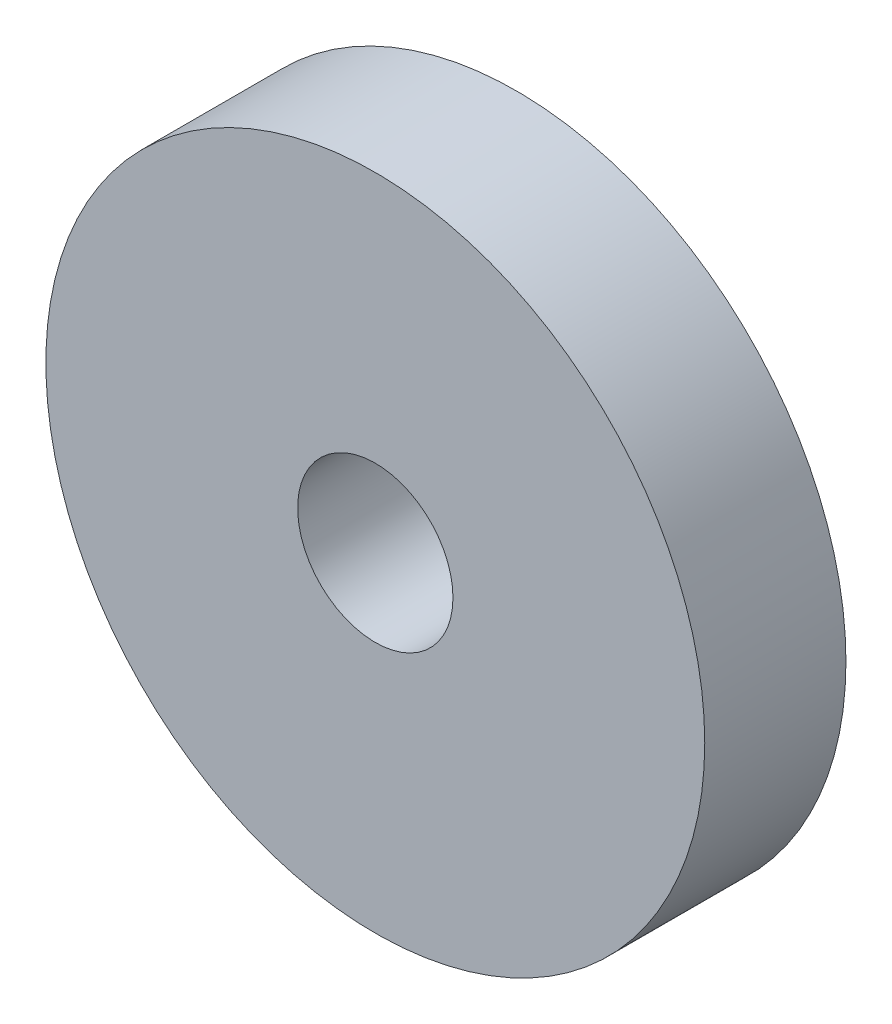
ISO-10303-21;
HEADER;
FILE_DESCRIPTION(('STEP AP214'),'2;1');
FILE_NAME('part.step','',(''),(''),'','','');
FILE_SCHEMA(('AUTOMOTIVE_DESIGN { 1 0 10303 214 1 1 1 1 }'));
ENDSEC;
DATA;
#1=APPLICATION_CONTEXT('core data for automotive mechanical design processes');
#2=APPLICATION_PROTOCOL_DEFINITION('international standard','automotive_design',2000,#1);
#3=PRODUCT_CONTEXT('',#1,'mechanical');
#4=PRODUCT('Part','Part','',(#3));
#5=PRODUCT_RELATED_PRODUCT_CATEGORY('part','',(#4));
#6=PRODUCT_DEFINITION_FORMATION('','',#4);
#7=PRODUCT_DEFINITION_CONTEXT('part definition',#1,'design');
#8=PRODUCT_DEFINITION('design','',#6,#7);
#9=PRODUCT_DEFINITION_SHAPE('','',#8);
#10=(LENGTH_UNIT() NAMED_UNIT(*) SI_UNIT(.MILLI.,.METRE.));
#11=(NAMED_UNIT(*) PLANE_ANGLE_UNIT() SI_UNIT($,.RADIAN.));
#12=(NAMED_UNIT(*) SI_UNIT($,.STERADIAN.) SOLID_ANGLE_UNIT());
#13=UNCERTAINTY_MEASURE_WITH_UNIT(LENGTH_MEASURE(1.E-05),#10,'distance_accuracy_value','');
#14=(GEOMETRIC_REPRESENTATION_CONTEXT(3) GLOBAL_UNCERTAINTY_ASSIGNED_CONTEXT((#13)) GLOBAL_UNIT_ASSIGNED_CONTEXT((#10,
#11,#12)) REPRESENTATION_CONTEXT('',''));
#15=CARTESIAN_POINT('',(0.,0.,0.));
#16=DIRECTION('',(0.,0.,1.));
#17=DIRECTION('',(1.,0.,0.));
#18=AXIS2_PLACEMENT_3D('',#15,#16,#17);
#19=CARTESIAN_POINT('',(0.,0.,3.));
#20=DIRECTION('',(0.,0.,-1.));
#21=DIRECTION('',(-1.,0.,0.));
#22=AXIS2_PLACEMENT_3D('',#19,#20,#21);
#23=CYLINDRICAL_SURFACE('',#22,7.);
#24=CARTESIAN_POINT('',(0.,0.,3.));
#25=DIRECTION('',(0.,0.,1.));
#26=DIRECTION('',(1.,0.,0.));
#27=AXIS2_PLACEMENT_3D('',#24,#25,#26);
#28=CIRCLE('',#27,7.);
#29=CARTESIAN_POINT('',(7.,0.,3.));
#30=VERTEX_POINT('',#29);
#31=EDGE_CURVE('E10',#30,#30,#28,.T.);
#32=ORIENTED_EDGE('',*,*,#31,.F.);
#33=EDGE_LOOP('',(#32));
#34=FACE_BOUND('',#33,.T.);
#35=CARTESIAN_POINT('',(0.,0.,0.));
#36=DIRECTION('',(0.,0.,1.));
#37=DIRECTION('',(1.,0.,0.));
#38=AXIS2_PLACEMENT_3D('',#35,#36,#37);
#39=CIRCLE('',#38,7.);
#40=CARTESIAN_POINT('',(7.,0.,0.));
#41=VERTEX_POINT('',#40);
#42=EDGE_CURVE('E42',#41,#41,#39,.T.);
#43=ORIENTED_EDGE('',*,*,#42,.T.);
#44=EDGE_LOOP('',(#43));
#45=FACE_BOUND('',#44,.T.);
#46=ADVANCED_FACE('F39',(#34,#45),#23,.T.);
#47=CARTESIAN_POINT('',(0.,0.,3.));
#48=DIRECTION('',(0.,0.,1.));
#49=DIRECTION('',(1.,0.,0.));
#50=AXIS2_PLACEMENT_3D('',#47,#48,#49);
#51=PLANE('',#50);
#52=CARTESIAN_POINT('',(0.,0.,3.));
#53=DIRECTION('',(0.,0.,1.));
#54=DIRECTION('',(1.,0.,0.));
#55=AXIS2_PLACEMENT_3D('',#52,#53,#54);
#56=CIRCLE('',#55,1.65);
#57=CARTESIAN_POINT('',(1.65,0.,3.));
#58=VERTEX_POINT('',#57);
#59=EDGE_CURVE('E53',#58,#58,#56,.T.);
#60=ORIENTED_EDGE('',*,*,#59,.F.);
#61=EDGE_LOOP('',(#60));
#62=FACE_BOUND('',#61,.T.);
#63=ORIENTED_EDGE('',*,*,#31,.T.);
#64=EDGE_LOOP('',(#63));
#65=FACE_BOUND('',#64,.T.);
#66=ADVANCED_FACE('F59',(#62,#65),#51,.T.);
#67=CARTESIAN_POINT('',(0.,0.,0.));
#68=DIRECTION('',(0.,0.,1.));
#69=DIRECTION('',(1.,0.,0.));
#70=AXIS2_PLACEMENT_3D('',#67,#68,#69);
#71=PLANE('',#70);
#72=CARTESIAN_POINT('',(0.,0.,0.));
#73=DIRECTION('',(0.,0.,1.));
#74=DIRECTION('',(1.,0.,0.));
#75=AXIS2_PLACEMENT_3D('',#72,#73,#74);
#76=CIRCLE('',#75,1.65);
#77=CARTESIAN_POINT('',(1.65,0.,0.));
#78=VERTEX_POINT('',#77);
#79=EDGE_CURVE('E49',#78,#78,#76,.F.);
#80=ORIENTED_EDGE('',*,*,#79,.F.);
#81=EDGE_LOOP('',(#80));
#82=FACE_BOUND('',#81,.T.);
#83=ORIENTED_EDGE('',*,*,#42,.F.);
#84=EDGE_LOOP('',(#83));
#85=FACE_BOUND('',#84,.T.);
#86=ADVANCED_FACE('F61',(#82,#85),#71,.F.);
#87=CARTESIAN_POINT('',(0.,0.,-4.66690475583121));
#88=DIRECTION('',(0.,0.,1.));
#89=DIRECTION('',(1.,0.,0.));
#90=AXIS2_PLACEMENT_3D('',#87,#88,#89);
#91=CYLINDRICAL_SURFACE('',#90,1.65);
#92=ORIENTED_EDGE('',*,*,#79,.T.);
#93=EDGE_LOOP('',(#92));
#94=FACE_BOUND('',#93,.T.);
#95=ORIENTED_EDGE('',*,*,#59,.T.);
#96=EDGE_LOOP('',(#95));
#97=FACE_BOUND('',#96,.T.);
#98=ADVANCED_FACE('F57',(#94,#97),#91,.F.);
#99=CLOSED_SHELL('',(#46,#66,#86,#98));
#100=MANIFOLD_SOLID_BREP('B2',#99);
#101=ADVANCED_BREP_SHAPE_REPRESENTATION('',(#18,#100),#14);
#102=SHAPE_DEFINITION_REPRESENTATION(#9,#101);
ENDSEC;
END-ISO-10303-21;
